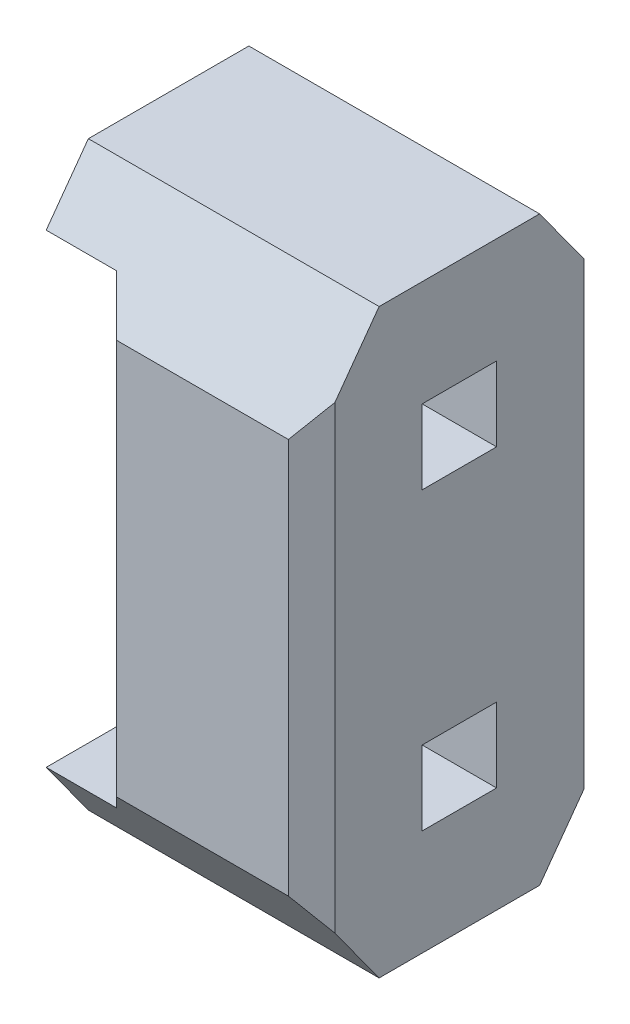
ISO-10303-21;
HEADER;
FILE_DESCRIPTION(('STEP AP214'),'2;1');
FILE_NAME('part.step','',(''),(''),'','','');
FILE_SCHEMA(('AUTOMOTIVE_DESIGN { 1 0 10303 214 1 1 1 1 }'));
ENDSEC;
DATA;
#1=APPLICATION_CONTEXT('core data for automotive mechanical design processes');
#2=APPLICATION_PROTOCOL_DEFINITION('international standard','automotive_design',2000,#1);
#3=PRODUCT_CONTEXT('',#1,'mechanical');
#4=PRODUCT('Part','Part','',(#3));
#5=PRODUCT_RELATED_PRODUCT_CATEGORY('part','',(#4));
#6=PRODUCT_DEFINITION_FORMATION('','',#4);
#7=PRODUCT_DEFINITION_CONTEXT('part definition',#1,'design');
#8=PRODUCT_DEFINITION('design','',#6,#7);
#9=PRODUCT_DEFINITION_SHAPE('','',#8);
#10=(LENGTH_UNIT() NAMED_UNIT(*) SI_UNIT(.MILLI.,.METRE.));
#11=(NAMED_UNIT(*) PLANE_ANGLE_UNIT() SI_UNIT($,.RADIAN.));
#12=(NAMED_UNIT(*) SI_UNIT($,.STERADIAN.) SOLID_ANGLE_UNIT());
#13=UNCERTAINTY_MEASURE_WITH_UNIT(LENGTH_MEASURE(1.E-05),#10,'distance_accuracy_value','');
#14=(GEOMETRIC_REPRESENTATION_CONTEXT(3) GLOBAL_UNCERTAINTY_ASSIGNED_CONTEXT((#13)) GLOBAL_UNIT_ASSIGNED_CONTEXT((#10,
#11,#12)) REPRESENTATION_CONTEXT('',''));
#15=CARTESIAN_POINT('',(0.,0.,0.));
#16=DIRECTION('',(0.,0.,1.));
#17=DIRECTION('',(1.,0.,0.));
#18=AXIS2_PLACEMENT_3D('',#15,#16,#17);
#19=CARTESIAN_POINT('',(1.25,4.6,-12.99));
#20=DIRECTION('',(0.,0.586967571460905,0.809610443394407));
#21=DIRECTION('',(0.,-0.809610443394407,0.586967571460905));
#22=AXIS2_PLACEMENT_3D('',#19,#20,#21);
#23=PLANE('',#22);
#24=DIRECTION('',(1.,0.,0.));
#25=VECTOR('',#24,1.);
#26=CARTESIAN_POINT('',(1.25,4.5,-12.9175));
#27=LINE('',#26,#25);
#28=CARTESIAN_POINT('',(0.,4.5,-12.9175));
#29=VERTEX_POINT('',#28);
#30=CARTESIAN_POINT('',(0.602500000000325,4.5,-12.9175000000001));
#31=VERTEX_POINT('',#30);
#32=EDGE_CURVE('E199',#29,#31,#27,.T.);
#33=ORIENTED_EDGE('',*,*,#32,.T.);
#34=DIRECTION('',(0.506207656348696,-0.698217457033983,0.506207656349604));
#35=VECTOR('',#34,1.);
#36=CARTESIAN_POINT('',(0.6025000000002,4.5,-12.9175));
#37=LINE('',#36,#35);
#38=CARTESIAN_POINT('',(0.819999999999671,4.2,-12.6999999999999));
#39=VERTEX_POINT('',#38);
#40=EDGE_CURVE('E197',#31,#39,#37,.T.);
#41=ORIENTED_EDGE('',*,*,#40,.T.);
#42=DIRECTION('',(1.,0.,0.));
#43=VECTOR('',#42,1.);
#44=CARTESIAN_POINT('',(1.25,4.19999999999999,-12.7));
#45=LINE('',#44,#43);
#46=CARTESIAN_POINT('',(2.30000000000012,4.2,-12.6999999999999));
#47=VERTEX_POINT('',#46);
#48=EDGE_CURVE('E20',#39,#47,#45,.T.);
#49=ORIENTED_EDGE('',*,*,#48,.T.);
#50=DIRECTION('',(0.506207656348956,0.698217457033859,-0.506207656349515));
#51=VECTOR('',#50,1.);
#52=CARTESIAN_POINT('',(2.3,4.19999999999999,-12.7));
#53=LINE('',#52,#51);
#54=CARTESIAN_POINT('',(2.49999999999988,4.47586206896591,-12.9000000000002));
#55=VERTEX_POINT('',#54);
#56=EDGE_CURVE('E181',#47,#55,#53,.T.);
#57=ORIENTED_EDGE('',*,*,#56,.T.);
#58=DIRECTION('',(0.,-0.809610443394407,0.586967571460905));
#59=VECTOR('',#58,1.);
#60=CARTESIAN_POINT('',(2.5,4.6,-12.99));
#61=LINE('',#60,#59);
#62=CARTESIAN_POINT('',(2.5,5.,-13.28));
#63=VERTEX_POINT('',#62);
#64=EDGE_CURVE('E188',#55,#63,#61,.F.);
#65=ORIENTED_EDGE('',*,*,#64,.T.);
#66=DIRECTION('',(1.,0.,0.));
#67=VECTOR('',#66,1.);
#68=CARTESIAN_POINT('',(1.25,5.,-13.28));
#69=LINE('',#68,#67);
#70=CARTESIAN_POINT('',(0.,5.,-13.28));
#71=VERTEX_POINT('',#70);
#72=EDGE_CURVE('E215',#71,#63,#69,.T.);
#73=ORIENTED_EDGE('',*,*,#72,.F.);
#74=DIRECTION('',(0.,-0.809610443394407,0.586967571460905));
#75=VECTOR('',#74,1.);
#76=CARTESIAN_POINT('',(0.,4.6,-12.99));
#77=LINE('',#76,#75);
#78=EDGE_CURVE('E207',#71,#29,#77,.T.);
#79=ORIENTED_EDGE('',*,*,#78,.T.);
#80=EDGE_LOOP('',(#33,#41,#49,#57,#65,#73,#79));
#81=FACE_BOUND('',#80,.T.);
#82=ADVANCED_FACE('F17',(#81),#23,.T.);
#83=CARTESIAN_POINT('',(1.25,4.6,-14.95));
#84=DIRECTION('',(0.,-0.586967571460905,0.809610443394407));
#85=DIRECTION('',(0.,-0.809610443394407,-0.586967571460905));
#86=AXIS2_PLACEMENT_3D('',#83,#84,#85);
#87=PLANE('',#86);
#88=DIRECTION('',(0.,-0.809610443394407,-0.586967571460905));
#89=VECTOR('',#88,1.);
#90=CARTESIAN_POINT('',(0.,4.6,-14.95));
#91=LINE('',#90,#89);
#92=CARTESIAN_POINT('',(0.,5.,-14.66));
#93=VERTEX_POINT('',#92);
#94=CARTESIAN_POINT('',(0.,4.5,-15.0225));
#95=VERTEX_POINT('',#94);
#96=EDGE_CURVE('E263',#93,#95,#91,.T.);
#97=ORIENTED_EDGE('',*,*,#96,.F.);
#98=DIRECTION('',(1.,0.,0.));
#99=VECTOR('',#98,1.);
#100=CARTESIAN_POINT('',(1.25,5.,-14.66));
#101=LINE('',#100,#99);
#102=CARTESIAN_POINT('',(2.5,5.,-14.66));
#103=VERTEX_POINT('',#102);
#104=EDGE_CURVE('E227',#103,#93,#101,.F.);
#105=ORIENTED_EDGE('',*,*,#104,.F.);
#106=DIRECTION('',(0.,-0.809610443394407,-0.586967571460905));
#107=VECTOR('',#106,1.);
#108=CARTESIAN_POINT('',(2.5,4.6,-14.95));
#109=LINE('',#108,#107);
#110=CARTESIAN_POINT('',(2.49999999999988,4.47586206896591,-15.0399999999998));
#111=VERTEX_POINT('',#110);
#112=EDGE_CURVE('E223',#111,#103,#109,.F.);
#113=ORIENTED_EDGE('',*,*,#112,.F.);
#114=DIRECTION('',(0.506207656348956,0.698217457033859,0.506207656349515));
#115=VECTOR('',#114,1.);
#116=CARTESIAN_POINT('',(2.3,4.19999999999999,-15.24));
#117=LINE('',#116,#115);
#118=CARTESIAN_POINT('',(2.30000000000012,4.2,-15.2400000000001));
#119=VERTEX_POINT('',#118);
#120=EDGE_CURVE('E266',#119,#111,#117,.T.);
#121=ORIENTED_EDGE('',*,*,#120,.F.);
#122=DIRECTION('',(1.,0.,0.));
#123=VECTOR('',#122,1.);
#124=CARTESIAN_POINT('',(1.25,4.19999999999999,-15.24));
#125=LINE('',#124,#123);
#126=CARTESIAN_POINT('',(0.819999999999671,4.2,-15.2400000000001));
#127=VERTEX_POINT('',#126);
#128=EDGE_CURVE('E205',#127,#119,#125,.T.);
#129=ORIENTED_EDGE('',*,*,#128,.F.);
#130=DIRECTION('',(0.506207656348696,-0.698217457033982,-0.506207656349605));
#131=VECTOR('',#130,1.);
#132=CARTESIAN_POINT('',(0.6025000000002,4.5,-15.0225));
#133=LINE('',#132,#131);
#134=CARTESIAN_POINT('',(0.602500000000325,4.5,-15.0224999999999));
#135=VERTEX_POINT('',#134);
#136=EDGE_CURVE('E203',#135,#127,#133,.T.);
#137=ORIENTED_EDGE('',*,*,#136,.F.);
#138=DIRECTION('',(1.,0.,0.));
#139=VECTOR('',#138,1.);
#140=CARTESIAN_POINT('',(1.25,4.5,-15.0225));
#141=LINE('',#140,#139);
#142=EDGE_CURVE('E261',#95,#135,#141,.T.);
#143=ORIENTED_EDGE('',*,*,#142,.F.);
#144=EDGE_LOOP('',(#97,#105,#113,#121,#129,#137,#143));
#145=FACE_BOUND('',#144,.T.);
#146=ADVANCED_FACE('F285',(#145),#87,.F.);
#147=CARTESIAN_POINT('',(1.25,0.4,-14.95));
#148=DIRECTION('',(0.,0.586967571460905,0.809610443394407));
#149=DIRECTION('',(0.,-0.809610443394407,0.586967571460905));
#150=AXIS2_PLACEMENT_3D('',#147,#148,#149);
#151=PLANE('',#150);
#152=DIRECTION('',(-0.506207656349403,0.698217457033647,-0.50620765634936));
#153=VECTOR('',#152,1.);
#154=CARTESIAN_POINT('',(2.5,0.524137931034496,-15.04));
#155=LINE('',#154,#153);
#156=CARTESIAN_POINT('',(2.49999999999988,0.524137931034498,-15.0399999999999));
#157=VERTEX_POINT('',#156);
#158=CARTESIAN_POINT('',(2.30000000000012,0.800000000000005,-15.2400000000001));
#159=VERTEX_POINT('',#158);
#160=EDGE_CURVE('E251',#157,#159,#155,.T.);
#161=ORIENTED_EDGE('',*,*,#160,.F.);
#162=DIRECTION('',(0.,-0.809610443394407,0.586967571460905));
#163=VECTOR('',#162,1.);
#164=CARTESIAN_POINT('',(2.5,0.4,-14.95));
#165=LINE('',#164,#163);
#166=CARTESIAN_POINT('',(2.5,0.,-14.66));
#167=VERTEX_POINT('',#166);
#168=EDGE_CURVE('E253',#167,#157,#165,.F.);
#169=ORIENTED_EDGE('',*,*,#168,.F.);
#170=DIRECTION('',(1.,0.,0.));
#171=VECTOR('',#170,1.);
#172=CARTESIAN_POINT('',(1.25,0.,-14.66));
#173=LINE('',#172,#171);
#174=CARTESIAN_POINT('',(0.,0.,-14.66));
#175=VERTEX_POINT('',#174);
#176=EDGE_CURVE('E288',#167,#175,#173,.F.);
#177=ORIENTED_EDGE('',*,*,#176,.T.);
#178=DIRECTION('',(0.,-0.809610443394407,0.586967571460905));
#179=VECTOR('',#178,1.);
#180=CARTESIAN_POINT('',(0.,0.4,-14.95));
#181=LINE('',#180,#179);
#182=CARTESIAN_POINT('',(0.,0.500000000000002,-15.0225));
#183=VERTEX_POINT('',#182);
#184=EDGE_CURVE('E255',#183,#175,#181,.T.);
#185=ORIENTED_EDGE('',*,*,#184,.F.);
#186=DIRECTION('',(1.,0.,0.));
#187=VECTOR('',#186,1.);
#188=CARTESIAN_POINT('',(1.25,0.500000000000003,-15.0225));
#189=LINE('',#188,#187);
#190=CARTESIAN_POINT('',(0.602500000000325,0.500000000000002,-15.0224999999999));
#191=VERTEX_POINT('',#190);
#192=EDGE_CURVE('E257',#191,#183,#189,.F.);
#193=ORIENTED_EDGE('',*,*,#192,.F.);
#194=DIRECTION('',(-0.506207656348697,-0.698217457033984,0.506207656349602));
#195=VECTOR('',#194,1.);
#196=CARTESIAN_POINT('',(0.8199999999998,0.800000000000009,-15.24));
#197=LINE('',#196,#195);
#198=CARTESIAN_POINT('',(0.819999999999671,0.800000000000005,-15.2400000000001));
#199=VERTEX_POINT('',#198);
#200=EDGE_CURVE('E259',#199,#191,#197,.T.);
#201=ORIENTED_EDGE('',*,*,#200,.F.);
#202=DIRECTION('',(1.,0.,0.));
#203=VECTOR('',#202,1.);
#204=CARTESIAN_POINT('',(1.25,0.800000000000009,-15.24));
#205=LINE('',#204,#203);
#206=EDGE_CURVE('E249',#159,#199,#205,.F.);
#207=ORIENTED_EDGE('',*,*,#206,.F.);
#208=EDGE_LOOP('',(#161,#169,#177,#185,#193,#201,#207));
#209=FACE_BOUND('',#208,.T.);
#210=ADVANCED_FACE('F431',(#209),#151,.F.);
#211=CARTESIAN_POINT('',(1.25,0.4,-12.99));
#212=DIRECTION('',(0.,-0.586967571460905,0.809610443394407));
#213=DIRECTION('',(0.,-0.809610443394407,-0.586967571460905));
#214=AXIS2_PLACEMENT_3D('',#211,#212,#213);
#215=PLANE('',#214);
#216=DIRECTION('',(1.,0.,0.));
#217=VECTOR('',#216,1.);
#218=CARTESIAN_POINT('',(1.25,0.800000000000009,-12.7));
#219=LINE('',#218,#217);
#220=CARTESIAN_POINT('',(2.30000000000012,0.800000000000005,-12.6999999999999));
#221=VERTEX_POINT('',#220);
#222=CARTESIAN_POINT('',(0.819999999999671,0.800000000000004,-12.6999999999999));
#223=VERTEX_POINT('',#222);
#224=EDGE_CURVE('E191',#221,#223,#219,.F.);
#225=ORIENTED_EDGE('',*,*,#224,.T.);
#226=DIRECTION('',(-0.506207656348695,-0.698217457033984,-0.506207656349603));
#227=VECTOR('',#226,1.);
#228=CARTESIAN_POINT('',(0.8199999999998,0.800000000000009,-12.7));
#229=LINE('',#228,#227);
#230=CARTESIAN_POINT('',(0.602500000000325,0.500000000000001,-12.9175000000001));
#231=VERTEX_POINT('',#230);
#232=EDGE_CURVE('E232',#223,#231,#229,.T.);
#233=ORIENTED_EDGE('',*,*,#232,.T.);
#234=DIRECTION('',(1.,0.,0.));
#235=VECTOR('',#234,1.);
#236=CARTESIAN_POINT('',(1.25,0.500000000000002,-12.9175));
#237=LINE('',#236,#235);
#238=CARTESIAN_POINT('',(0.,0.500000000000001,-12.9175));
#239=VERTEX_POINT('',#238);
#240=EDGE_CURVE('E246',#231,#239,#237,.F.);
#241=ORIENTED_EDGE('',*,*,#240,.T.);
#242=DIRECTION('',(0.,-0.809610443394407,-0.586967571460905));
#243=VECTOR('',#242,1.);
#244=CARTESIAN_POINT('',(0.,0.4,-12.99));
#245=LINE('',#244,#243);
#246=CARTESIAN_POINT('',(0.,0.,-13.28));
#247=VERTEX_POINT('',#246);
#248=EDGE_CURVE('E244',#239,#247,#245,.T.);
#249=ORIENTED_EDGE('',*,*,#248,.T.);
#250=DIRECTION('',(1.,0.,0.));
#251=VECTOR('',#250,1.);
#252=CARTESIAN_POINT('',(1.25,0.,-13.28));
#253=LINE('',#252,#251);
#254=CARTESIAN_POINT('',(2.5,0.,-13.28));
#255=VERTEX_POINT('',#254);
#256=EDGE_CURVE('E293',#247,#255,#253,.T.);
#257=ORIENTED_EDGE('',*,*,#256,.T.);
#258=DIRECTION('',(0.,-0.809610443394407,-0.586967571460905));
#259=VECTOR('',#258,1.);
#260=CARTESIAN_POINT('',(2.5,0.4,-12.99));
#261=LINE('',#260,#259);
#262=CARTESIAN_POINT('',(2.49999999999988,0.524137931034498,-12.9000000000001));
#263=VERTEX_POINT('',#262);
#264=EDGE_CURVE('E241',#255,#263,#261,.F.);
#265=ORIENTED_EDGE('',*,*,#264,.T.);
#266=DIRECTION('',(-0.506207656349403,0.698217457033647,0.50620765634936));
#267=VECTOR('',#266,1.);
#268=CARTESIAN_POINT('',(2.5,0.524137931034496,-12.9));
#269=LINE('',#268,#267);
#270=EDGE_CURVE('E239',#263,#221,#269,.T.);
#271=ORIENTED_EDGE('',*,*,#270,.T.);
#272=EDGE_LOOP('',(#225,#233,#241,#249,#257,#265,#271));
#273=FACE_BOUND('',#272,.T.);
#274=ADVANCED_FACE('F421',(#273),#215,.T.);
#275=CARTESIAN_POINT('',(1.25,5.,-13.97));
#276=DIRECTION('',(0.,1.,0.));
#277=DIRECTION('',(0.,0.,1.));
#278=AXIS2_PLACEMENT_3D('',#275,#276,#277);
#279=PLANE('',#278);
#280=ORIENTED_EDGE('',*,*,#104,.T.);
#281=DIRECTION('',(0.,0.,-1.));
#282=VECTOR('',#281,1.);
#283=CARTESIAN_POINT('',(0.,5.,-13.97));
#284=LINE('',#283,#282);
#285=EDGE_CURVE('E231',#93,#71,#284,.F.);
#286=ORIENTED_EDGE('',*,*,#285,.T.);
#287=ORIENTED_EDGE('',*,*,#72,.T.);
#288=DIRECTION('',(0.,0.,1.));
#289=VECTOR('',#288,1.);
#290=CARTESIAN_POINT('',(2.5,5.,-13.97));
#291=LINE('',#290,#289);
#292=EDGE_CURVE('E219',#63,#103,#291,.F.);
#293=ORIENTED_EDGE('',*,*,#292,.T.);
#294=EDGE_LOOP('',(#280,#286,#287,#293));
#295=FACE_BOUND('',#294,.T.);
#296=ADVANCED_FACE('F229',(#295),#279,.T.);
#297=CARTESIAN_POINT('',(1.25,0.,-13.97));
#298=DIRECTION('',(0.,1.,0.));
#299=DIRECTION('',(0.,0.,1.));
#300=AXIS2_PLACEMENT_3D('',#297,#298,#299);
#301=PLANE('',#300);
#302=DIRECTION('',(0.,0.,-1.));
#303=VECTOR('',#302,1.);
#304=CARTESIAN_POINT('',(0.,0.,-13.97));
#305=LINE('',#304,#303);
#306=EDGE_CURVE('E297',#247,#175,#305,.T.);
#307=ORIENTED_EDGE('',*,*,#306,.T.);
#308=ORIENTED_EDGE('',*,*,#176,.F.);
#309=DIRECTION('',(0.,0.,1.));
#310=VECTOR('',#309,1.);
#311=CARTESIAN_POINT('',(2.5,0.,-13.97));
#312=LINE('',#311,#310);
#313=EDGE_CURVE('E287',#255,#167,#312,.F.);
#314=ORIENTED_EDGE('',*,*,#313,.F.);
#315=ORIENTED_EDGE('',*,*,#256,.F.);
#316=EDGE_LOOP('',(#307,#308,#314,#315));
#317=FACE_BOUND('',#316,.T.);
#318=ADVANCED_FACE('F428',(#317),#301,.F.);
#319=CARTESIAN_POINT('',(0.,4.75,-13.97));
#320=DIRECTION('',(1.,0.,0.));
#321=DIRECTION('',(0.,0.,-1.));
#322=AXIS2_PLACEMENT_3D('',#319,#320,#321);
#323=PLANE('',#322);
#324=ORIENTED_EDGE('',*,*,#285,.F.);
#325=ORIENTED_EDGE('',*,*,#96,.T.);
#326=DIRECTION('',(0.,0.,1.));
#327=VECTOR('',#326,1.);
#328=CARTESIAN_POINT('',(0.,4.5,-13.97));
#329=LINE('',#328,#327);
#330=EDGE_CURVE('E307',#95,#29,#329,.T.);
#331=ORIENTED_EDGE('',*,*,#330,.T.);
#332=ORIENTED_EDGE('',*,*,#78,.F.);
#333=EDGE_LOOP('',(#324,#325,#331,#332));
#334=FACE_BOUND('',#333,.T.);
#335=ADVANCED_FACE('F441',(#334),#323,.F.);
#336=CARTESIAN_POINT('',(0.,0.25,-13.97));
#337=DIRECTION('',(1.,0.,0.));
#338=DIRECTION('',(0.,0.,-1.));
#339=AXIS2_PLACEMENT_3D('',#336,#337,#338);
#340=PLANE('',#339);
#341=ORIENTED_EDGE('',*,*,#306,.F.);
#342=ORIENTED_EDGE('',*,*,#248,.F.);
#343=DIRECTION('',(0.,0.,1.));
#344=VECTOR('',#343,1.);
#345=CARTESIAN_POINT('',(0.,0.5,-13.97));
#346=LINE('',#345,#344);
#347=EDGE_CURVE('E315',#183,#239,#346,.T.);
#348=ORIENTED_EDGE('',*,*,#347,.F.);
#349=ORIENTED_EDGE('',*,*,#184,.T.);
#350=EDGE_LOOP('',(#341,#342,#348,#349));
#351=FACE_BOUND('',#350,.T.);
#352=ADVANCED_FACE('F443',(#351),#340,.F.);
#353=CARTESIAN_POINT('',(1.55,3.45,-13.97));
#354=DIRECTION('',(0.,1.,0.));
#355=DIRECTION('',(0.,0.,1.));
#356=AXIS2_PLACEMENT_3D('',#353,#354,#355);
#357=PLANE('',#356);
#358=DIRECTION('',(1.,0.,0.));
#359=VECTOR('',#358,1.);
#360=CARTESIAN_POINT('',(1.55,3.45,-14.29));
#361=LINE('',#360,#359);
#362=CARTESIAN_POINT('',(0.6,3.45,-14.29));
#363=VERTEX_POINT('',#362);
#364=CARTESIAN_POINT('',(2.5,3.45,-14.29));
#365=VERTEX_POINT('',#364);
#366=EDGE_CURVE('E332',#363,#365,#361,.T.);
#367=ORIENTED_EDGE('',*,*,#366,.F.);
#368=DIRECTION('',(0.,0.,1.));
#369=VECTOR('',#368,1.);
#370=CARTESIAN_POINT('',(0.6,3.45,-13.97));
#371=LINE('',#370,#369);
#372=CARTESIAN_POINT('',(0.6,3.45,-13.65));
#373=VERTEX_POINT('',#372);
#374=EDGE_CURVE('E302',#363,#373,#371,.T.);
#375=ORIENTED_EDGE('',*,*,#374,.T.);
#376=DIRECTION('',(1.,0.,0.));
#377=VECTOR('',#376,1.);
#378=CARTESIAN_POINT('',(1.55,3.45,-13.65));
#379=LINE('',#378,#377);
#380=CARTESIAN_POINT('',(2.5,3.45,-13.65));
#381=VERTEX_POINT('',#380);
#382=EDGE_CURVE('E327',#373,#381,#379,.T.);
#383=ORIENTED_EDGE('',*,*,#382,.T.);
#384=DIRECTION('',(0.,0.,1.));
#385=VECTOR('',#384,1.);
#386=CARTESIAN_POINT('',(2.5,3.45,-13.97));
#387=LINE('',#386,#385);
#388=EDGE_CURVE('E300',#381,#365,#387,.F.);
#389=ORIENTED_EDGE('',*,*,#388,.T.);
#390=EDGE_LOOP('',(#367,#375,#383,#389));
#391=FACE_BOUND('',#390,.T.);
#392=ADVANCED_FACE('F398',(#391),#357,.T.);
#393=CARTESIAN_POINT('',(0.71,2.5,-15.13));
#394=DIRECTION('',(0.707106781190498,0.,0.707106781182598));
#395=DIRECTION('',(0.707106781182598,0.,-0.707106781190498));
#396=AXIS2_PLACEMENT_3D('',#393,#394,#395);
#397=PLANE('',#396);
#398=ORIENTED_EDGE('',*,*,#200,.T.);
#399=DIRECTION('',(0.707106781186425,0.,-0.70710678118667));
#400=VECTOR('',#399,1.);
#401=CARTESIAN_POINT('',(0.6000000000002,0.5,-15.02));
#402=LINE('',#401,#400);
#403=CARTESIAN_POINT('',(0.600000000000407,0.5,-15.0199999999997));
#404=VERTEX_POINT('',#403);
#405=EDGE_CURVE('E312',#404,#191,#402,.T.);
#406=ORIENTED_EDGE('',*,*,#405,.F.);
#407=DIRECTION('',(0.,1.,0.));
#408=VECTOR('',#407,1.);
#409=CARTESIAN_POINT('',(0.6,2.5,-15.02));
#410=LINE('',#409,#408);
#411=CARTESIAN_POINT('',(0.600000000000407,4.5,-15.0199999999997));
#412=VERTEX_POINT('',#411);
#413=EDGE_CURVE('E337',#404,#412,#410,.T.);
#414=ORIENTED_EDGE('',*,*,#413,.T.);
#415=DIRECTION('',(0.707106781186425,0.,-0.70710678118667));
#416=VECTOR('',#415,1.);
#417=CARTESIAN_POINT('',(0.6000000000002,4.5,-15.02));
#418=LINE('',#417,#416);
#419=EDGE_CURVE('E304',#412,#135,#418,.T.);
#420=ORIENTED_EDGE('',*,*,#419,.T.);
#421=ORIENTED_EDGE('',*,*,#136,.T.);
#422=DIRECTION('',(0.,1.,0.));
#423=VECTOR('',#422,1.);
#424=CARTESIAN_POINT('',(0.8199999999998,2.5,-15.24));
#425=LINE('',#424,#423);
#426=EDGE_CURVE('E275',#127,#199,#425,.F.);
#427=ORIENTED_EDGE('',*,*,#426,.T.);
#428=EDGE_LOOP('',(#398,#406,#414,#420,#421,#427));
#429=FACE_BOUND('',#428,.T.);
#430=ADVANCED_FACE('F435',(#429),#397,.F.);
#431=CARTESIAN_POINT('',(0.30125,4.5,-13.97));
#432=DIRECTION('',(0.,1.,0.));
#433=DIRECTION('',(0.,0.,1.));
#434=AXIS2_PLACEMENT_3D('',#431,#432,#433);
#435=PLANE('',#434);
#436=ORIENTED_EDGE('',*,*,#142,.T.);
#437=ORIENTED_EDGE('',*,*,#419,.F.);
#438=DIRECTION('',(0.,0.,-1.));
#439=VECTOR('',#438,1.);
#440=CARTESIAN_POINT('',(0.6,4.5,-13.97));
#441=LINE('',#440,#439);
#442=CARTESIAN_POINT('',(0.600000000000279,4.5,-12.9200000000001));
#443=VERTEX_POINT('',#442);
#444=EDGE_CURVE('E339',#412,#443,#441,.F.);
#445=ORIENTED_EDGE('',*,*,#444,.T.);
#446=DIRECTION('',(-0.707106781182598,0.,-0.707106781190498));
#447=VECTOR('',#446,1.);
#448=CARTESIAN_POINT('',(0.71,4.5,-12.81));
#449=LINE('',#448,#447);
#450=EDGE_CURVE('E310',#443,#31,#449,.F.);
#451=ORIENTED_EDGE('',*,*,#450,.T.);
#452=ORIENTED_EDGE('',*,*,#32,.F.);
#453=ORIENTED_EDGE('',*,*,#330,.F.);
#454=EDGE_LOOP('',(#436,#437,#445,#451,#452,#453));
#455=FACE_BOUND('',#454,.T.);
#456=ADVANCED_FACE('F439',(#455),#435,.F.);
#457=CARTESIAN_POINT('',(0.71,2.5,-12.81));
#458=DIRECTION('',(0.707106781190498,0.,-0.707106781182598));
#459=DIRECTION('',(-0.707106781182598,0.,-0.707106781190498));
#460=AXIS2_PLACEMENT_3D('',#457,#458,#459);
#461=PLANE('',#460);
#462=ORIENTED_EDGE('',*,*,#232,.F.);
#463=DIRECTION('',(0.,1.,0.));
#464=VECTOR('',#463,1.);
#465=CARTESIAN_POINT('',(0.8199999999998,2.5,-12.7));
#466=LINE('',#465,#464);
#467=EDGE_CURVE('E325',#39,#223,#466,.F.);
#468=ORIENTED_EDGE('',*,*,#467,.F.);
#469=ORIENTED_EDGE('',*,*,#40,.F.);
#470=ORIENTED_EDGE('',*,*,#450,.F.);
#471=DIRECTION('',(0.,1.,0.));
#472=VECTOR('',#471,1.);
#473=CARTESIAN_POINT('',(0.6,2.5,-12.92));
#474=LINE('',#473,#472);
#475=CARTESIAN_POINT('',(0.600000000000407,0.5,-12.9200000000003));
#476=VERTEX_POINT('',#475);
#477=EDGE_CURVE('E341',#443,#476,#474,.F.);
#478=ORIENTED_EDGE('',*,*,#477,.T.);
#479=DIRECTION('',(-0.707106781186425,0.,-0.70710678118667));
#480=VECTOR('',#479,1.);
#481=CARTESIAN_POINT('',(0.6025000000002,0.5,-12.9175));
#482=LINE('',#481,#480);
#483=EDGE_CURVE('E318',#231,#476,#482,.T.);
#484=ORIENTED_EDGE('',*,*,#483,.F.);
#485=EDGE_LOOP('',(#462,#468,#469,#470,#478,#484));
#486=FACE_BOUND('',#485,.T.);
#487=ADVANCED_FACE('F416',(#486),#461,.F.);
#488=CARTESIAN_POINT('',(0.30125,0.5,-13.97));
#489=DIRECTION('',(0.,1.,0.));
#490=DIRECTION('',(0.,0.,1.));
#491=AXIS2_PLACEMENT_3D('',#488,#489,#490);
#492=PLANE('',#491);
#493=ORIENTED_EDGE('',*,*,#483,.T.);
#494=DIRECTION('',(0.,0.,-1.));
#495=VECTOR('',#494,1.);
#496=CARTESIAN_POINT('',(0.6,0.5,-13.97));
#497=LINE('',#496,#495);
#498=EDGE_CURVE('E343',#476,#404,#497,.T.);
#499=ORIENTED_EDGE('',*,*,#498,.T.);
#500=ORIENTED_EDGE('',*,*,#405,.T.);
#501=ORIENTED_EDGE('',*,*,#192,.T.);
#502=ORIENTED_EDGE('',*,*,#347,.T.);
#503=ORIENTED_EDGE('',*,*,#240,.F.);
#504=EDGE_LOOP('',(#493,#499,#500,#501,#502,#503));
#505=FACE_BOUND('',#504,.T.);
#506=ADVANCED_FACE('F418',(#505),#492,.T.);
#507=CARTESIAN_POINT('',(1.55,1.23,-14.29));
#508=DIRECTION('',(0.,0.,1.));
#509=DIRECTION('',(1.,0.,0.));
#510=AXIS2_PLACEMENT_3D('',#507,#508,#509);
#511=PLANE('',#510);
#512=DIRECTION('',(1.,0.,0.));
#513=VECTOR('',#512,1.);
#514=CARTESIAN_POINT('',(1.55,1.55,-14.29));
#515=LINE('',#514,#513);
#516=CARTESIAN_POINT('',(2.5,1.55,-14.29));
#517=VERTEX_POINT('',#516);
#518=CARTESIAN_POINT('',(0.6,1.55,-14.29));
#519=VERTEX_POINT('',#518);
#520=EDGE_CURVE('E283',#517,#519,#515,.F.);
#521=ORIENTED_EDGE('',*,*,#520,.T.);
#522=DIRECTION('',(0.,1.,0.));
#523=VECTOR('',#522,1.);
#524=CARTESIAN_POINT('',(0.6,2.5,-14.29));
#525=LINE('',#524,#523);
#526=CARTESIAN_POINT('',(0.6,0.91,-14.29));
#527=VERTEX_POINT('',#526);
#528=EDGE_CURVE('E346',#519,#527,#525,.F.);
#529=ORIENTED_EDGE('',*,*,#528,.T.);
#530=DIRECTION('',(1.,0.,0.));
#531=VECTOR('',#530,1.);
#532=CARTESIAN_POINT('',(1.55,0.91,-14.29));
#533=LINE('',#532,#531);
#534=CARTESIAN_POINT('',(2.5,0.91,-14.29));
#535=VERTEX_POINT('',#534);
#536=EDGE_CURVE('E354',#535,#527,#533,.F.);
#537=ORIENTED_EDGE('',*,*,#536,.F.);
#538=DIRECTION('',(0.,1.,0.));
#539=VECTOR('',#538,1.);
#540=CARTESIAN_POINT('',(2.5,1.23,-14.29));
#541=LINE('',#540,#539);
#542=EDGE_CURVE('E321',#535,#517,#541,.T.);
#543=ORIENTED_EDGE('',*,*,#542,.T.);
#544=EDGE_LOOP('',(#521,#529,#537,#543));
#545=FACE_BOUND('',#544,.T.);
#546=ADVANCED_FACE('F483',(#545),#511,.T.);
#547=CARTESIAN_POINT('',(1.56,2.5,-15.24));
#548=DIRECTION('',(0.,0.,1.));
#549=DIRECTION('',(1.,0.,0.));
#550=AXIS2_PLACEMENT_3D('',#547,#548,#549);
#551=PLANE('',#550);
#552=DIRECTION('',(0.,1.,0.));
#553=VECTOR('',#552,1.);
#554=CARTESIAN_POINT('',(2.30000000000047,2.5,-15.2400000000005));
#555=LINE('',#554,#553);
#556=EDGE_CURVE('E193',#159,#119,#555,.T.);
#557=ORIENTED_EDGE('',*,*,#556,.F.);
#558=ORIENTED_EDGE('',*,*,#206,.T.);
#559=ORIENTED_EDGE('',*,*,#426,.F.);
#560=ORIENTED_EDGE('',*,*,#128,.T.);
#561=EDGE_LOOP('',(#557,#558,#559,#560));
#562=FACE_BOUND('',#561,.T.);
#563=ADVANCED_FACE('F272',(#562),#551,.F.);
#564=CARTESIAN_POINT('',(1.56,2.5,-12.7));
#565=DIRECTION('',(0.,0.,1.));
#566=DIRECTION('',(1.,0.,0.));
#567=AXIS2_PLACEMENT_3D('',#564,#565,#566);
#568=PLANE('',#567);
#569=ORIENTED_EDGE('',*,*,#48,.F.);
#570=ORIENTED_EDGE('',*,*,#467,.T.);
#571=ORIENTED_EDGE('',*,*,#224,.F.);
#572=DIRECTION('',(0.,1.,0.));
#573=VECTOR('',#572,1.);
#574=CARTESIAN_POINT('',(2.30000000000047,2.5,-12.6999999999995));
#575=LINE('',#574,#573);
#576=EDGE_CURVE('E183',#47,#221,#575,.F.);
#577=ORIENTED_EDGE('',*,*,#576,.F.);
#578=EDGE_LOOP('',(#569,#570,#571,#577));
#579=FACE_BOUND('',#578,.T.);
#580=ADVANCED_FACE('F189',(#579),#568,.T.);
#581=CARTESIAN_POINT('',(1.55,3.77,-13.65));
#582=DIRECTION('',(0.,0.,1.));
#583=DIRECTION('',(1.,0.,0.));
#584=AXIS2_PLACEMENT_3D('',#581,#582,#583);
#585=PLANE('',#584);
#586=DIRECTION('',(0.,1.,0.));
#587=VECTOR('',#586,1.);
#588=CARTESIAN_POINT('',(2.5,3.77,-13.65));
#589=LINE('',#588,#587);
#590=CARTESIAN_POINT('',(2.5,4.09,-13.65));
#591=VERTEX_POINT('',#590);
#592=EDGE_CURVE('E330',#381,#591,#589,.T.);
#593=ORIENTED_EDGE('',*,*,#592,.F.);
#594=ORIENTED_EDGE('',*,*,#382,.F.);
#595=DIRECTION('',(0.,1.,0.));
#596=VECTOR('',#595,1.);
#597=CARTESIAN_POINT('',(0.6,2.5,-13.65));
#598=LINE('',#597,#596);
#599=CARTESIAN_POINT('',(0.6,4.09,-13.65));
#600=VERTEX_POINT('',#599);
#601=EDGE_CURVE('E351',#373,#600,#598,.T.);
#602=ORIENTED_EDGE('',*,*,#601,.T.);
#603=DIRECTION('',(1.,0.,0.));
#604=VECTOR('',#603,1.);
#605=CARTESIAN_POINT('',(1.55,4.09,-13.65));
#606=LINE('',#605,#604);
#607=EDGE_CURVE('E368',#600,#591,#606,.T.);
#608=ORIENTED_EDGE('',*,*,#607,.T.);
#609=EDGE_LOOP('',(#593,#594,#602,#608));
#610=FACE_BOUND('',#609,.T.);
#611=ADVANCED_FACE('F402',(#610),#585,.F.);
#612=CARTESIAN_POINT('',(1.55,3.77,-14.29));
#613=DIRECTION('',(0.,0.,1.));
#614=DIRECTION('',(1.,0.,0.));
#615=AXIS2_PLACEMENT_3D('',#612,#613,#614);
#616=PLANE('',#615);
#617=DIRECTION('',(1.,0.,0.));
#618=VECTOR('',#617,1.);
#619=CARTESIAN_POINT('',(1.55,4.09,-14.29));
#620=LINE('',#619,#618);
#621=CARTESIAN_POINT('',(2.5,4.09,-14.29));
#622=VERTEX_POINT('',#621);
#623=CARTESIAN_POINT('',(0.6,4.09,-14.29));
#624=VERTEX_POINT('',#623);
#625=EDGE_CURVE('E371',#622,#624,#620,.F.);
#626=ORIENTED_EDGE('',*,*,#625,.T.);
#627=DIRECTION('',(0.,1.,0.));
#628=VECTOR('',#627,1.);
#629=CARTESIAN_POINT('',(0.6,2.5,-14.29));
#630=LINE('',#629,#628);
#631=EDGE_CURVE('E348',#624,#363,#630,.F.);
#632=ORIENTED_EDGE('',*,*,#631,.T.);
#633=ORIENTED_EDGE('',*,*,#366,.T.);
#634=DIRECTION('',(0.,1.,0.));
#635=VECTOR('',#634,1.);
#636=CARTESIAN_POINT('',(2.5,3.77,-14.29));
#637=LINE('',#636,#635);
#638=EDGE_CURVE('E335',#365,#622,#637,.T.);
#639=ORIENTED_EDGE('',*,*,#638,.T.);
#640=EDGE_LOOP('',(#626,#632,#633,#639));
#641=FACE_BOUND('',#640,.T.);
#642=ADVANCED_FACE('F395',(#641),#616,.T.);
#643=CARTESIAN_POINT('',(0.6,2.5,-13.97));
#644=DIRECTION('',(1.,0.,0.));
#645=DIRECTION('',(0.,0.,-1.));
#646=AXIS2_PLACEMENT_3D('',#643,#644,#645);
#647=PLANE('',#646);
#648=ORIENTED_EDGE('',*,*,#374,.F.);
#649=ORIENTED_EDGE('',*,*,#631,.F.);
#650=DIRECTION('',(0.,0.,1.));
#651=VECTOR('',#650,1.);
#652=CARTESIAN_POINT('',(0.6,4.09,-13.97));
#653=LINE('',#652,#651);
#654=EDGE_CURVE('E192',#624,#600,#653,.T.);
#655=ORIENTED_EDGE('',*,*,#654,.T.);
#656=ORIENTED_EDGE('',*,*,#601,.F.);
#657=EDGE_LOOP('',(#648,#649,#655,#656));
#658=FACE_BOUND('',#657,.T.);
#659=ORIENTED_EDGE('',*,*,#528,.F.);
#660=DIRECTION('',(0.,0.,1.));
#661=VECTOR('',#660,1.);
#662=CARTESIAN_POINT('',(0.6,1.55,-13.97));
#663=LINE('',#662,#661);
#664=CARTESIAN_POINT('',(0.6,1.55,-13.65));
#665=VERTEX_POINT('',#664);
#666=EDGE_CURVE('E360',#519,#665,#663,.T.);
#667=ORIENTED_EDGE('',*,*,#666,.T.);
#668=DIRECTION('',(0.,1.,0.));
#669=VECTOR('',#668,1.);
#670=CARTESIAN_POINT('',(0.6,1.23,-13.65));
#671=LINE('',#670,#669);
#672=CARTESIAN_POINT('',(0.6,0.91,-13.65));
#673=VERTEX_POINT('',#672);
#674=EDGE_CURVE('E374',#665,#673,#671,.F.);
#675=ORIENTED_EDGE('',*,*,#674,.T.);
#676=DIRECTION('',(0.,0.,1.));
#677=VECTOR('',#676,1.);
#678=CARTESIAN_POINT('',(0.6,0.91,-13.97));
#679=LINE('',#678,#677);
#680=EDGE_CURVE('E357',#527,#673,#679,.T.);
#681=ORIENTED_EDGE('',*,*,#680,.F.);
#682=EDGE_LOOP('',(#659,#667,#675,#681));
#683=FACE_BOUND('',#682,.T.);
#684=ORIENTED_EDGE('',*,*,#477,.F.);
#685=ORIENTED_EDGE('',*,*,#444,.F.);
#686=ORIENTED_EDGE('',*,*,#413,.F.);
#687=ORIENTED_EDGE('',*,*,#498,.F.);
#688=EDGE_LOOP('',(#684,#685,#686,#687));
#689=FACE_BOUND('',#688,.T.);
#690=ADVANCED_FACE('F404',(#658,#683,#689),#647,.F.);
#691=CARTESIAN_POINT('',(1.55,0.91,-13.97));
#692=DIRECTION('',(0.,1.,0.));
#693=DIRECTION('',(0.,0.,1.));
#694=AXIS2_PLACEMENT_3D('',#691,#692,#693);
#695=PLANE('',#694);
#696=ORIENTED_EDGE('',*,*,#536,.T.);
#697=ORIENTED_EDGE('',*,*,#680,.T.);
#698=DIRECTION('',(1.,0.,0.));
#699=VECTOR('',#698,1.);
#700=CARTESIAN_POINT('',(1.55,0.91,-13.65));
#701=LINE('',#700,#699);
#702=CARTESIAN_POINT('',(2.5,0.91,-13.65));
#703=VERTEX_POINT('',#702);
#704=EDGE_CURVE('E376',#673,#703,#701,.T.);
#705=ORIENTED_EDGE('',*,*,#704,.T.);
#706=DIRECTION('',(0.,0.,1.));
#707=VECTOR('',#706,1.);
#708=CARTESIAN_POINT('',(2.5,0.91,-13.97));
#709=LINE('',#708,#707);
#710=EDGE_CURVE('E34',#703,#535,#709,.F.);
#711=ORIENTED_EDGE('',*,*,#710,.T.);
#712=EDGE_LOOP('',(#696,#697,#705,#711));
#713=FACE_BOUND('',#712,.T.);
#714=ADVANCED_FACE('F407',(#713),#695,.T.);
#715=CARTESIAN_POINT('',(1.55,1.55,-13.97));
#716=DIRECTION('',(0.,1.,0.));
#717=DIRECTION('',(0.,0.,1.));
#718=AXIS2_PLACEMENT_3D('',#715,#716,#717);
#719=PLANE('',#718);
#720=DIRECTION('',(0.,0.,1.));
#721=VECTOR('',#720,1.);
#722=CARTESIAN_POINT('',(2.5,1.55,-13.97));
#723=LINE('',#722,#721);
#724=CARTESIAN_POINT('',(2.5,1.55,-13.65));
#725=VERTEX_POINT('',#724);
#726=EDGE_CURVE('E362',#725,#517,#723,.F.);
#727=ORIENTED_EDGE('',*,*,#726,.F.);
#728=DIRECTION('',(1.,0.,0.));
#729=VECTOR('',#728,1.);
#730=CARTESIAN_POINT('',(1.55,1.55,-13.65));
#731=LINE('',#730,#729);
#732=EDGE_CURVE('E378',#725,#665,#731,.F.);
#733=ORIENTED_EDGE('',*,*,#732,.T.);
#734=ORIENTED_EDGE('',*,*,#666,.F.);
#735=ORIENTED_EDGE('',*,*,#520,.F.);
#736=EDGE_LOOP('',(#727,#733,#734,#735));
#737=FACE_BOUND('',#736,.T.);
#738=ADVANCED_FACE('F468',(#737),#719,.F.);
#739=CARTESIAN_POINT('',(2.4,2.5,-15.14));
#740=DIRECTION('',(0.707106781189898,0.,-0.707106781183198));
#741=DIRECTION('',(-0.707106781183198,0.,-0.707106781189898));
#742=AXIS2_PLACEMENT_3D('',#739,#740,#741);
#743=PLANE('',#742);
#744=DIRECTION('',(0.,1.,0.));
#745=VECTOR('',#744,1.);
#746=CARTESIAN_POINT('',(2.5,2.5,-15.04));
#747=LINE('',#746,#745);
#748=EDGE_CURVE('E381',#157,#111,#747,.T.);
#749=ORIENTED_EDGE('',*,*,#748,.F.);
#750=ORIENTED_EDGE('',*,*,#160,.T.);
#751=ORIENTED_EDGE('',*,*,#556,.T.);
#752=ORIENTED_EDGE('',*,*,#120,.T.);
#753=EDGE_LOOP('',(#749,#750,#751,#752));
#754=FACE_BOUND('',#753,.T.);
#755=ADVANCED_FACE('F281',(#754),#743,.T.);
#756=CARTESIAN_POINT('',(2.4,2.5,-12.8));
#757=DIRECTION('',(0.707106781189898,0.,0.707106781183198));
#758=DIRECTION('',(0.707106781183198,0.,-0.707106781189898));
#759=AXIS2_PLACEMENT_3D('',#756,#757,#758);
#760=PLANE('',#759);
#761=DIRECTION('',(0.,1.,0.));
#762=VECTOR('',#761,1.);
#763=CARTESIAN_POINT('',(2.5,2.5,-12.9));
#764=LINE('',#763,#762);
#765=EDGE_CURVE('E186',#55,#263,#764,.F.);
#766=ORIENTED_EDGE('',*,*,#765,.F.);
#767=ORIENTED_EDGE('',*,*,#56,.F.);
#768=ORIENTED_EDGE('',*,*,#576,.T.);
#769=ORIENTED_EDGE('',*,*,#270,.F.);
#770=EDGE_LOOP('',(#766,#767,#768,#769));
#771=FACE_BOUND('',#770,.T.);
#772=ADVANCED_FACE('F182',(#771),#760,.T.);
#773=CARTESIAN_POINT('',(1.55,4.09,-13.97));
#774=DIRECTION('',(0.,1.,0.));
#775=DIRECTION('',(0.,0.,1.));
#776=AXIS2_PLACEMENT_3D('',#773,#774,#775);
#777=PLANE('',#776);
#778=DIRECTION('',(0.,0.,-1.));
#779=VECTOR('',#778,1.);
#780=CARTESIAN_POINT('',(2.5,4.09,-13.97));
#781=LINE('',#780,#779);
#782=EDGE_CURVE('E26',#591,#622,#781,.T.);
#783=ORIENTED_EDGE('',*,*,#782,.F.);
#784=ORIENTED_EDGE('',*,*,#607,.F.);
#785=ORIENTED_EDGE('',*,*,#654,.F.);
#786=ORIENTED_EDGE('',*,*,#625,.F.);
#787=EDGE_LOOP('',(#783,#784,#785,#786));
#788=FACE_BOUND('',#787,.T.);
#789=ADVANCED_FACE('F392',(#788),#777,.F.);
#790=CARTESIAN_POINT('',(1.55,1.23,-13.65));
#791=DIRECTION('',(0.,0.,1.));
#792=DIRECTION('',(1.,0.,0.));
#793=AXIS2_PLACEMENT_3D('',#790,#791,#792);
#794=PLANE('',#793);
#795=DIRECTION('',(0.,1.,0.));
#796=VECTOR('',#795,1.);
#797=CARTESIAN_POINT('',(2.5,2.5,-13.65));
#798=LINE('',#797,#796);
#799=EDGE_CURVE('E11',#703,#725,#798,.T.);
#800=ORIENTED_EDGE('',*,*,#799,.F.);
#801=ORIENTED_EDGE('',*,*,#704,.F.);
#802=ORIENTED_EDGE('',*,*,#674,.F.);
#803=ORIENTED_EDGE('',*,*,#732,.F.);
#804=EDGE_LOOP('',(#800,#801,#802,#803));
#805=FACE_BOUND('',#804,.T.);
#806=ADVANCED_FACE('F454',(#805),#794,.F.);
#807=CARTESIAN_POINT('',(2.5,2.5,-13.97));
#808=DIRECTION('',(1.,0.,0.));
#809=DIRECTION('',(0.,0.,-1.));
#810=AXIS2_PLACEMENT_3D('',#807,#808,#809);
#811=PLANE('',#810);
#812=ORIENTED_EDGE('',*,*,#710,.F.);
#813=ORIENTED_EDGE('',*,*,#799,.T.);
#814=ORIENTED_EDGE('',*,*,#726,.T.);
#815=ORIENTED_EDGE('',*,*,#542,.F.);
#816=EDGE_LOOP('',(#812,#813,#814,#815));
#817=FACE_BOUND('',#816,.T.);
#818=ORIENTED_EDGE('',*,*,#592,.T.);
#819=ORIENTED_EDGE('',*,*,#782,.T.);
#820=ORIENTED_EDGE('',*,*,#638,.F.);
#821=ORIENTED_EDGE('',*,*,#388,.F.);
#822=EDGE_LOOP('',(#818,#819,#820,#821));
#823=FACE_BOUND('',#822,.T.);
#824=ORIENTED_EDGE('',*,*,#64,.F.);
#825=ORIENTED_EDGE('',*,*,#765,.T.);
#826=ORIENTED_EDGE('',*,*,#264,.F.);
#827=ORIENTED_EDGE('',*,*,#313,.T.);
#828=ORIENTED_EDGE('',*,*,#168,.T.);
#829=ORIENTED_EDGE('',*,*,#748,.T.);
#830=ORIENTED_EDGE('',*,*,#112,.T.);
#831=ORIENTED_EDGE('',*,*,#292,.F.);
#832=EDGE_LOOP('',(#824,#825,#826,#827,#828,#829,#830,#831));
#833=FACE_BOUND('',#832,.T.);
#834=ADVANCED_FACE('F220',(#817,#823,#833),#811,.T.);
#835=CLOSED_SHELL('',(#82,#146,#210,#274,#296,#318,#335,#352,#392,#430,#456,#487,#506,#546,#563,
#580,#611,#642,#690,#714,#738,#755,#772,#789,#806,#834));
#836=MANIFOLD_SOLID_BREP('B1',#835);
#837=ADVANCED_BREP_SHAPE_REPRESENTATION('',(#18,#836),#14);
#838=SHAPE_DEFINITION_REPRESENTATION(#9,#837);
ENDSEC;
END-ISO-10303-21;
